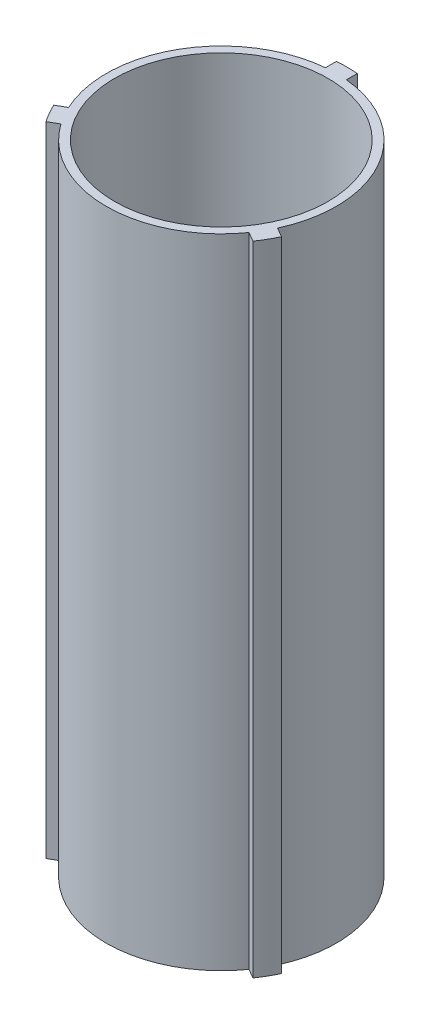
ISO-10303-21;
HEADER;
FILE_DESCRIPTION(('STEP AP214'),'2;1');
FILE_NAME('part.step','',(''),(''),'','','');
FILE_SCHEMA(('AUTOMOTIVE_DESIGN { 1 0 10303 214 1 1 1 1 }'));
ENDSEC;
DATA;
#1=APPLICATION_CONTEXT('core data for automotive mechanical design processes');
#2=APPLICATION_PROTOCOL_DEFINITION('international standard','automotive_design',2000,#1);
#3=PRODUCT_CONTEXT('',#1,'mechanical');
#4=PRODUCT('Part','Part','',(#3));
#5=PRODUCT_RELATED_PRODUCT_CATEGORY('part','',(#4));
#6=PRODUCT_DEFINITION_FORMATION('','',#4);
#7=PRODUCT_DEFINITION_CONTEXT('part definition',#1,'design');
#8=PRODUCT_DEFINITION('design','',#6,#7);
#9=PRODUCT_DEFINITION_SHAPE('','',#8);
#10=(LENGTH_UNIT() NAMED_UNIT(*) SI_UNIT(.MILLI.,.METRE.));
#11=(NAMED_UNIT(*) PLANE_ANGLE_UNIT() SI_UNIT($,.RADIAN.));
#12=(NAMED_UNIT(*) SI_UNIT($,.STERADIAN.) SOLID_ANGLE_UNIT());
#13=UNCERTAINTY_MEASURE_WITH_UNIT(LENGTH_MEASURE(1.E-05),#10,'distance_accuracy_value','');
#14=(GEOMETRIC_REPRESENTATION_CONTEXT(3) GLOBAL_UNCERTAINTY_ASSIGNED_CONTEXT((#13)) GLOBAL_UNIT_ASSIGNED_CONTEXT((#10,
#11,#12)) REPRESENTATION_CONTEXT('',''));
#15=CARTESIAN_POINT('',(0.,0.,0.));
#16=DIRECTION('',(0.,0.,1.));
#17=DIRECTION('',(1.,0.,0.));
#18=AXIS2_PLACEMENT_3D('',#15,#16,#17);
#19=CARTESIAN_POINT('',(0.,193.675,0.));
#20=DIRECTION('',(0.,1.,0.));
#21=DIRECTION('',(0.,0.,1.));
#22=AXIS2_PLACEMENT_3D('',#19,#20,#21);
#23=PLANE('',#22);
#24=CARTESIAN_POINT('',(0.,193.675,0.));
#25=DIRECTION('',(0.,1.,0.));
#26=DIRECTION('',(0.,0.,1.));
#27=AXIS2_PLACEMENT_3D('',#24,#25,#26);
#28=CIRCLE('',#27,38.227);
#29=CARTESIAN_POINT('',(3.175,193.675,-38.0949196612882));
#30=VERTEX_POINT('',#29);
#31=CARTESIAN_POINT('',(-3.175,193.675,-38.0949196612882));
#32=VERTEX_POINT('',#31);
#33=EDGE_CURVE('E176',#30,#32,#28,.T.);
#34=ORIENTED_EDGE('',*,*,#33,.T.);
#35=DIRECTION('',(0.,0.,1.));
#36=VECTOR('',#35,1.);
#37=CARTESIAN_POINT('',(-3.175,193.675,-34.780382401578));
#38=LINE('',#37,#36);
#39=CARTESIAN_POINT('',(-3.17499999999999,193.675,-34.780382401578));
#40=VERTEX_POINT('',#39);
#41=EDGE_CURVE('E104',#32,#40,#38,.T.);
#42=ORIENTED_EDGE('',*,*,#41,.T.);
#43=CARTESIAN_POINT('',(0.,193.675,0.));
#44=DIRECTION('',(0.,1.,0.));
#45=DIRECTION('',(0.,0.,1.));
#46=AXIS2_PLACEMENT_3D('',#43,#44,#45);
#47=CIRCLE('',#46,34.925);
#48=CARTESIAN_POINT('',(-31.7081947131034,193.675,14.6405605437742));
#49=VERTEX_POINT('',#48);
#50=EDGE_CURVE('E203',#40,#49,#47,.T.);
#51=ORIENTED_EDGE('',*,*,#50,.T.);
#52=DIRECTION('',(-0.866025403784438,0.,0.500000000000001));
#53=VECTOR('',#52,1.);
#54=CARTESIAN_POINT('',(-34.5786681818024,193.675,16.2978291736293));
#55=LINE('',#54,#53);
#56=CARTESIAN_POINT('',(-34.5786681818025,193.675,16.2978291736293));
#57=VERTEX_POINT('',#56);
#58=EDGE_CURVE('E222',#49,#57,#55,.T.);
#59=ORIENTED_EDGE('',*,*,#58,.T.);
#60=CARTESIAN_POINT('',(0.,193.675,0.));
#61=DIRECTION('',(0.,1.,0.));
#62=DIRECTION('',(0.,0.,1.));
#63=AXIS2_PLACEMENT_3D('',#60,#61,#62);
#64=CIRCLE('',#63,38.227);
#65=CARTESIAN_POINT('',(-31.4036681818023,193.675,21.7970904876604));
#66=VERTEX_POINT('',#65);
#67=EDGE_CURVE('E219',#57,#66,#64,.T.);
#68=ORIENTED_EDGE('',*,*,#67,.T.);
#69=DIRECTION('',(0.866025403784439,0.,-0.5));
#70=VECTOR('',#69,1.);
#71=CARTESIAN_POINT('',(-28.5331947131033,193.675,20.1398218578053));
#72=LINE('',#71,#70);
#73=CARTESIAN_POINT('',(-28.5331947131033,193.675,20.1398218578053));
#74=VERTEX_POINT('',#73);
#75=EDGE_CURVE('E221',#66,#74,#72,.T.);
#76=ORIENTED_EDGE('',*,*,#75,.T.);
#77=CARTESIAN_POINT('',(0.,193.675,0.));
#78=DIRECTION('',(0.,1.,0.));
#79=DIRECTION('',(0.,0.,1.));
#80=AXIS2_PLACEMENT_3D('',#77,#78,#79);
#81=CIRCLE('',#80,34.925);
#82=CARTESIAN_POINT('',(28.5331947131048,193.675,20.1398218578032));
#83=VERTEX_POINT('',#82);
#84=EDGE_CURVE('E224',#74,#83,#81,.T.);
#85=ORIENTED_EDGE('',*,*,#84,.T.);
#86=DIRECTION('',(0.866025403784439,0.,0.499999999999998));
#87=VECTOR('',#86,1.);
#88=CARTESIAN_POINT('',(31.4036681818038,193.675,21.7970904876583));
#89=LINE('',#88,#87);
#90=CARTESIAN_POINT('',(31.4036681818038,193.675,21.7970904876583));
#91=VERTEX_POINT('',#90);
#92=EDGE_CURVE('E230',#83,#91,#89,.T.);
#93=ORIENTED_EDGE('',*,*,#92,.T.);
#94=CARTESIAN_POINT('',(0.,193.675,0.));
#95=DIRECTION('',(0.,1.,0.));
#96=DIRECTION('',(0.,0.,1.));
#97=AXIS2_PLACEMENT_3D('',#94,#95,#96);
#98=CIRCLE('',#97,38.227);
#99=CARTESIAN_POINT('',(34.5786681818036,193.675,16.2978291736269));
#100=VERTEX_POINT('',#99);
#101=EDGE_CURVE('E135',#91,#100,#98,.T.);
#102=ORIENTED_EDGE('',*,*,#101,.T.);
#103=DIRECTION('',(-0.866025403784438,0.,-0.500000000000001));
#104=VECTOR('',#103,1.);
#105=CARTESIAN_POINT('',(31.7081947131045,193.675,14.6405605437719));
#106=LINE('',#105,#104);
#107=CARTESIAN_POINT('',(31.7081947131045,193.675,14.6405605437719));
#108=VERTEX_POINT('',#107);
#109=EDGE_CURVE('E129',#100,#108,#106,.T.);
#110=ORIENTED_EDGE('',*,*,#109,.T.);
#111=CARTESIAN_POINT('',(0.,193.675,0.));
#112=DIRECTION('',(0.,1.,0.));
#113=DIRECTION('',(0.,0.,1.));
#114=AXIS2_PLACEMENT_3D('',#111,#112,#113);
#115=CIRCLE('',#114,34.925);
#116=CARTESIAN_POINT('',(3.175,193.675,-34.780382401578));
#117=VERTEX_POINT('',#116);
#118=EDGE_CURVE('E133',#108,#117,#115,.T.);
#119=ORIENTED_EDGE('',*,*,#118,.T.);
#120=DIRECTION('',(0.,0.,-1.));
#121=VECTOR('',#120,1.);
#122=CARTESIAN_POINT('',(3.175,193.675,-38.0949196612882));
#123=LINE('',#122,#121);
#124=EDGE_CURVE('E49',#117,#30,#123,.T.);
#125=ORIENTED_EDGE('',*,*,#124,.T.);
#126=EDGE_LOOP('',(#34,#42,#51,#59,#68,#76,#85,#93,#102,#110,#119,#125));
#127=FACE_BOUND('',#126,.T.);
#128=CARTESIAN_POINT('',(0.,193.675,0.));
#129=DIRECTION('',(0.,1.,0.));
#130=DIRECTION('',(0.,0.,1.));
#131=AXIS2_PLACEMENT_3D('',#128,#129,#130);
#132=CIRCLE('',#131,32.385);
#133=CARTESIAN_POINT('',(0.,193.675,32.385));
#134=VERTEX_POINT('',#133);
#135=EDGE_CURVE('E157',#134,#134,#132,.T.);
#136=ORIENTED_EDGE('',*,*,#135,.F.);
#137=EDGE_LOOP('',(#136));
#138=FACE_BOUND('',#137,.T.);
#139=ADVANCED_FACE('F32',(#127,#138),#23,.T.);
#140=CARTESIAN_POINT('',(0.,0.,0.));
#141=DIRECTION('',(0.,1.,0.));
#142=DIRECTION('',(0.,0.,1.));
#143=AXIS2_PLACEMENT_3D('',#140,#141,#142);
#144=PLANE('',#143);
#145=CARTESIAN_POINT('',(0.,0.,0.));
#146=DIRECTION('',(0.,1.,0.));
#147=DIRECTION('',(0.,0.,1.));
#148=AXIS2_PLACEMENT_3D('',#145,#146,#147);
#149=CIRCLE('',#148,38.227);
#150=CARTESIAN_POINT('',(3.175,0.,-38.0949196612882));
#151=VERTEX_POINT('',#150);
#152=CARTESIAN_POINT('',(-3.175,0.,-38.0949196612882));
#153=VERTEX_POINT('',#152);
#154=EDGE_CURVE('E153',#151,#153,#149,.T.);
#155=ORIENTED_EDGE('',*,*,#154,.F.);
#156=DIRECTION('',(0.,0.,-1.));
#157=VECTOR('',#156,1.);
#158=CARTESIAN_POINT('',(3.175,0.,-38.0949196612882));
#159=LINE('',#158,#157);
#160=CARTESIAN_POINT('',(3.175,0.,-34.780382401578));
#161=VERTEX_POINT('',#160);
#162=EDGE_CURVE('E96',#161,#151,#159,.T.);
#163=ORIENTED_EDGE('',*,*,#162,.F.);
#164=CARTESIAN_POINT('',(0.,0.,0.));
#165=DIRECTION('',(0.,1.,0.));
#166=DIRECTION('',(0.,0.,1.));
#167=AXIS2_PLACEMENT_3D('',#164,#165,#166);
#168=CIRCLE('',#167,34.925);
#169=CARTESIAN_POINT('',(31.7081947131045,0.,14.6405605437719));
#170=VERTEX_POINT('',#169);
#171=EDGE_CURVE('E90',#170,#161,#168,.T.);
#172=ORIENTED_EDGE('',*,*,#171,.F.);
#173=DIRECTION('',(-0.866025403784438,0.,-0.500000000000001));
#174=VECTOR('',#173,1.);
#175=CARTESIAN_POINT('',(31.7081947131045,0.,14.6405605437719));
#176=LINE('',#175,#174);
#177=CARTESIAN_POINT('',(34.5786681818036,0.,16.2978291736269));
#178=VERTEX_POINT('',#177);
#179=EDGE_CURVE('E143',#178,#170,#176,.T.);
#180=ORIENTED_EDGE('',*,*,#179,.F.);
#181=CARTESIAN_POINT('',(0.,0.,0.));
#182=DIRECTION('',(0.,1.,0.));
#183=DIRECTION('',(0.,0.,1.));
#184=AXIS2_PLACEMENT_3D('',#181,#182,#183);
#185=CIRCLE('',#184,38.227);
#186=CARTESIAN_POINT('',(31.4036681818038,0.,21.7970904876583));
#187=VERTEX_POINT('',#186);
#188=EDGE_CURVE('E171',#187,#178,#185,.T.);
#189=ORIENTED_EDGE('',*,*,#188,.F.);
#190=DIRECTION('',(0.866025403784439,0.,0.499999999999998));
#191=VECTOR('',#190,1.);
#192=CARTESIAN_POINT('',(31.4036681818038,0.,21.7970904876583));
#193=LINE('',#192,#191);
#194=CARTESIAN_POINT('',(28.5331947131048,0.,20.1398218578032));
#195=VERTEX_POINT('',#194);
#196=EDGE_CURVE('E169',#195,#187,#193,.T.);
#197=ORIENTED_EDGE('',*,*,#196,.F.);
#198=CARTESIAN_POINT('',(0.,0.,0.));
#199=DIRECTION('',(0.,1.,0.));
#200=DIRECTION('',(0.,0.,1.));
#201=AXIS2_PLACEMENT_3D('',#198,#199,#200);
#202=CIRCLE('',#201,34.925);
#203=CARTESIAN_POINT('',(-28.5331947131033,0.,20.1398218578053));
#204=VERTEX_POINT('',#203);
#205=EDGE_CURVE('E167',#204,#195,#202,.T.);
#206=ORIENTED_EDGE('',*,*,#205,.F.);
#207=DIRECTION('',(0.866025403784439,0.,-0.5));
#208=VECTOR('',#207,1.);
#209=CARTESIAN_POINT('',(-28.5331947131033,0.,20.1398218578053));
#210=LINE('',#209,#208);
#211=CARTESIAN_POINT('',(-31.4036681818023,0.,21.7970904876604));
#212=VERTEX_POINT('',#211);
#213=EDGE_CURVE('E165',#212,#204,#210,.T.);
#214=ORIENTED_EDGE('',*,*,#213,.F.);
#215=CARTESIAN_POINT('',(0.,0.,0.));
#216=DIRECTION('',(0.,1.,0.));
#217=DIRECTION('',(0.,0.,1.));
#218=AXIS2_PLACEMENT_3D('',#215,#216,#217);
#219=CIRCLE('',#218,38.227);
#220=CARTESIAN_POINT('',(-34.5786681818025,0.,16.2978291736293));
#221=VERTEX_POINT('',#220);
#222=EDGE_CURVE('E163',#221,#212,#219,.T.);
#223=ORIENTED_EDGE('',*,*,#222,.F.);
#224=DIRECTION('',(-0.866025403784438,0.,0.500000000000001));
#225=VECTOR('',#224,1.);
#226=CARTESIAN_POINT('',(-34.5786681818024,0.,16.2978291736293));
#227=LINE('',#226,#225);
#228=CARTESIAN_POINT('',(-31.7081947131034,0.,14.6405605437742));
#229=VERTEX_POINT('',#228);
#230=EDGE_CURVE('E161',#229,#221,#227,.T.);
#231=ORIENTED_EDGE('',*,*,#230,.F.);
#232=CARTESIAN_POINT('',(0.,0.,0.));
#233=DIRECTION('',(0.,1.,0.));
#234=DIRECTION('',(0.,0.,1.));
#235=AXIS2_PLACEMENT_3D('',#232,#233,#234);
#236=CIRCLE('',#235,34.925);
#237=CARTESIAN_POINT('',(-3.17499999999999,0.,-34.780382401578));
#238=VERTEX_POINT('',#237);
#239=EDGE_CURVE('E159',#238,#229,#236,.T.);
#240=ORIENTED_EDGE('',*,*,#239,.F.);
#241=DIRECTION('',(0.,0.,1.));
#242=VECTOR('',#241,1.);
#243=CARTESIAN_POINT('',(-3.175,0.,-34.780382401578));
#244=LINE('',#243,#242);
#245=EDGE_CURVE('E156',#153,#238,#244,.T.);
#246=ORIENTED_EDGE('',*,*,#245,.F.);
#247=EDGE_LOOP('',(#155,#163,#172,#180,#189,#197,#206,#214,#223,#231,#240,#246));
#248=FACE_BOUND('',#247,.T.);
#249=CARTESIAN_POINT('',(0.,0.,0.));
#250=DIRECTION('',(0.,1.,0.));
#251=DIRECTION('',(0.,0.,1.));
#252=AXIS2_PLACEMENT_3D('',#249,#250,#251);
#253=CIRCLE('',#252,32.385);
#254=CARTESIAN_POINT('',(0.,0.,32.385));
#255=VERTEX_POINT('',#254);
#256=EDGE_CURVE('E377',#255,#255,#253,.T.);
#257=ORIENTED_EDGE('',*,*,#256,.T.);
#258=EDGE_LOOP('',(#257));
#259=FACE_BOUND('',#258,.T.);
#260=ADVANCED_FACE('F207',(#248,#259),#144,.F.);
#261=CARTESIAN_POINT('',(0.,193.675,0.));
#262=DIRECTION('',(0.,-1.,0.));
#263=DIRECTION('',(0.,0.,-1.));
#264=AXIS2_PLACEMENT_3D('',#261,#262,#263);
#265=CYLINDRICAL_SURFACE('',#264,38.227);
#266=ORIENTED_EDGE('',*,*,#154,.T.);
#267=DIRECTION('',(0.,-1.,0.));
#268=VECTOR('',#267,1.);
#269=CARTESIAN_POINT('',(-3.175,193.675,-38.0949196612882));
#270=LINE('',#269,#268);
#271=EDGE_CURVE('E11',#32,#153,#270,.T.);
#272=ORIENTED_EDGE('',*,*,#271,.F.);
#273=ORIENTED_EDGE('',*,*,#33,.F.);
#274=DIRECTION('',(0.,-1.,0.));
#275=VECTOR('',#274,1.);
#276=CARTESIAN_POINT('',(3.175,193.675,-38.0949196612882));
#277=LINE('',#276,#275);
#278=EDGE_CURVE('E149',#30,#151,#277,.T.);
#279=ORIENTED_EDGE('',*,*,#278,.T.);
#280=EDGE_LOOP('',(#266,#272,#273,#279));
#281=FACE_BOUND('',#280,.T.);
#282=ADVANCED_FACE('F34',(#281),#265,.T.);
#283=CARTESIAN_POINT('',(-3.175,193.675,-34.780382401578));
#284=DIRECTION('',(1.,0.,0.));
#285=DIRECTION('',(0.,0.,-1.));
#286=AXIS2_PLACEMENT_3D('',#283,#284,#285);
#287=PLANE('',#286);
#288=ORIENTED_EDGE('',*,*,#245,.T.);
#289=DIRECTION('',(0.,-1.,0.));
#290=VECTOR('',#289,1.);
#291=CARTESIAN_POINT('',(-3.17499999999999,193.675,-34.780382401578));
#292=LINE('',#291,#290);
#293=EDGE_CURVE('E41',#40,#238,#292,.T.);
#294=ORIENTED_EDGE('',*,*,#293,.F.);
#295=ORIENTED_EDGE('',*,*,#41,.F.);
#296=ORIENTED_EDGE('',*,*,#271,.T.);
#297=EDGE_LOOP('',(#288,#294,#295,#296));
#298=FACE_BOUND('',#297,.T.);
#299=ADVANCED_FACE('F264',(#298),#287,.F.);
#300=CARTESIAN_POINT('',(0.,193.675,0.));
#301=DIRECTION('',(0.,-1.,0.));
#302=DIRECTION('',(0.,0.,-1.));
#303=AXIS2_PLACEMENT_3D('',#300,#301,#302);
#304=CYLINDRICAL_SURFACE('',#303,34.925);
#305=ORIENTED_EDGE('',*,*,#239,.T.);
#306=DIRECTION('',(0.,-1.,0.));
#307=VECTOR('',#306,1.);
#308=CARTESIAN_POINT('',(-31.7081947131034,193.675,14.6405605437742));
#309=LINE('',#308,#307);
#310=EDGE_CURVE('E195',#49,#229,#309,.T.);
#311=ORIENTED_EDGE('',*,*,#310,.F.);
#312=ORIENTED_EDGE('',*,*,#50,.F.);
#313=ORIENTED_EDGE('',*,*,#293,.T.);
#314=EDGE_LOOP('',(#305,#311,#312,#313));
#315=FACE_BOUND('',#314,.T.);
#316=ADVANCED_FACE('F201',(#315),#304,.T.);
#317=CARTESIAN_POINT('',(-34.5786681818024,193.675,16.2978291736293));
#318=DIRECTION('',(0.500000000000001,0.,0.866025403784438));
#319=DIRECTION('',(0.866025403784438,0.,-0.500000000000001));
#320=AXIS2_PLACEMENT_3D('',#317,#318,#319);
#321=PLANE('',#320);
#322=ORIENTED_EDGE('',*,*,#230,.T.);
#323=DIRECTION('',(0.,-1.,0.));
#324=VECTOR('',#323,1.);
#325=CARTESIAN_POINT('',(-34.5786681818025,193.675,16.2978291736293));
#326=LINE('',#325,#324);
#327=EDGE_CURVE('E192',#57,#221,#326,.T.);
#328=ORIENTED_EDGE('',*,*,#327,.F.);
#329=ORIENTED_EDGE('',*,*,#58,.F.);
#330=ORIENTED_EDGE('',*,*,#310,.T.);
#331=EDGE_LOOP('',(#322,#328,#329,#330));
#332=FACE_BOUND('',#331,.T.);
#333=ADVANCED_FACE('F213',(#332),#321,.F.);
#334=CARTESIAN_POINT('',(0.,193.675,0.));
#335=DIRECTION('',(0.,-1.,0.));
#336=DIRECTION('',(0.,0.,-1.));
#337=AXIS2_PLACEMENT_3D('',#334,#335,#336);
#338=CYLINDRICAL_SURFACE('',#337,38.227);
#339=ORIENTED_EDGE('',*,*,#222,.T.);
#340=DIRECTION('',(0.,-1.,0.));
#341=VECTOR('',#340,1.);
#342=CARTESIAN_POINT('',(-31.4036681818023,193.675,21.7970904876604));
#343=LINE('',#342,#341);
#344=EDGE_CURVE('E189',#66,#212,#343,.T.);
#345=ORIENTED_EDGE('',*,*,#344,.F.);
#346=ORIENTED_EDGE('',*,*,#67,.F.);
#347=ORIENTED_EDGE('',*,*,#327,.T.);
#348=EDGE_LOOP('',(#339,#345,#346,#347));
#349=FACE_BOUND('',#348,.T.);
#350=ADVANCED_FACE('F217',(#349),#338,.T.);
#351=CARTESIAN_POINT('',(-28.5331947131033,193.675,20.1398218578053));
#352=DIRECTION('',(-0.5,0.,-0.866025403784439));
#353=DIRECTION('',(-0.866025403784439,0.,0.5));
#354=AXIS2_PLACEMENT_3D('',#351,#352,#353);
#355=PLANE('',#354);
#356=ORIENTED_EDGE('',*,*,#213,.T.);
#357=DIRECTION('',(0.,-1.,0.));
#358=VECTOR('',#357,1.);
#359=CARTESIAN_POINT('',(-28.5331947131033,193.675,20.1398218578053));
#360=LINE('',#359,#358);
#361=EDGE_CURVE('E186',#74,#204,#360,.T.);
#362=ORIENTED_EDGE('',*,*,#361,.F.);
#363=ORIENTED_EDGE('',*,*,#75,.F.);
#364=ORIENTED_EDGE('',*,*,#344,.T.);
#365=EDGE_LOOP('',(#356,#362,#363,#364));
#366=FACE_BOUND('',#365,.T.);
#367=ADVANCED_FACE('F277',(#366),#355,.F.);
#368=CARTESIAN_POINT('',(0.,193.675,0.));
#369=DIRECTION('',(0.,-1.,0.));
#370=DIRECTION('',(0.,0.,-1.));
#371=AXIS2_PLACEMENT_3D('',#368,#369,#370);
#372=CYLINDRICAL_SURFACE('',#371,34.925);
#373=ORIENTED_EDGE('',*,*,#205,.T.);
#374=DIRECTION('',(0.,-1.,0.));
#375=VECTOR('',#374,1.);
#376=CARTESIAN_POINT('',(28.5331947131048,193.675,20.1398218578032));
#377=LINE('',#376,#375);
#378=EDGE_CURVE('E183',#83,#195,#377,.T.);
#379=ORIENTED_EDGE('',*,*,#378,.F.);
#380=ORIENTED_EDGE('',*,*,#84,.F.);
#381=ORIENTED_EDGE('',*,*,#361,.T.);
#382=EDGE_LOOP('',(#373,#379,#380,#381));
#383=FACE_BOUND('',#382,.T.);
#384=ADVANCED_FACE('F280',(#383),#372,.T.);
#385=CARTESIAN_POINT('',(31.4036681818038,193.675,21.7970904876583));
#386=DIRECTION('',(0.499999999999998,0.,-0.866025403784439));
#387=DIRECTION('',(-0.86602540378444,0.,-0.499999999999999));
#388=AXIS2_PLACEMENT_3D('',#385,#386,#387);
#389=PLANE('',#388);
#390=ORIENTED_EDGE('',*,*,#196,.T.);
#391=DIRECTION('',(0.,-1.,0.));
#392=VECTOR('',#391,1.);
#393=CARTESIAN_POINT('',(31.4036681818038,193.675,21.7970904876583));
#394=LINE('',#393,#392);
#395=EDGE_CURVE('E180',#91,#187,#394,.T.);
#396=ORIENTED_EDGE('',*,*,#395,.F.);
#397=ORIENTED_EDGE('',*,*,#92,.F.);
#398=ORIENTED_EDGE('',*,*,#378,.T.);
#399=EDGE_LOOP('',(#390,#396,#397,#398));
#400=FACE_BOUND('',#399,.T.);
#401=ADVANCED_FACE('F236',(#400),#389,.F.);
#402=CARTESIAN_POINT('',(0.,193.675,0.));
#403=DIRECTION('',(0.,-1.,0.));
#404=DIRECTION('',(0.,0.,-1.));
#405=AXIS2_PLACEMENT_3D('',#402,#403,#404);
#406=CYLINDRICAL_SURFACE('',#405,38.227);
#407=ORIENTED_EDGE('',*,*,#188,.T.);
#408=DIRECTION('',(0.,-1.,0.));
#409=VECTOR('',#408,1.);
#410=CARTESIAN_POINT('',(34.5786681818036,193.675,16.2978291736269));
#411=LINE('',#410,#409);
#412=EDGE_CURVE('E144',#100,#178,#411,.T.);
#413=ORIENTED_EDGE('',*,*,#412,.F.);
#414=ORIENTED_EDGE('',*,*,#101,.F.);
#415=ORIENTED_EDGE('',*,*,#395,.T.);
#416=EDGE_LOOP('',(#407,#413,#414,#415));
#417=FACE_BOUND('',#416,.T.);
#418=ADVANCED_FACE('F240',(#417),#406,.T.);
#419=CARTESIAN_POINT('',(31.7081947131045,193.675,14.6405605437719));
#420=DIRECTION('',(-0.500000000000001,0.,0.866025403784438));
#421=DIRECTION('',(0.866025403784438,0.,0.500000000000002));
#422=AXIS2_PLACEMENT_3D('',#419,#420,#421);
#423=PLANE('',#422);
#424=ORIENTED_EDGE('',*,*,#179,.T.);
#425=DIRECTION('',(0.,-1.,0.));
#426=VECTOR('',#425,1.);
#427=CARTESIAN_POINT('',(31.7081947131045,193.675,14.6405605437719));
#428=LINE('',#427,#426);
#429=EDGE_CURVE('E140',#108,#170,#428,.T.);
#430=ORIENTED_EDGE('',*,*,#429,.F.);
#431=ORIENTED_EDGE('',*,*,#109,.F.);
#432=ORIENTED_EDGE('',*,*,#412,.T.);
#433=EDGE_LOOP('',(#424,#430,#431,#432));
#434=FACE_BOUND('',#433,.T.);
#435=ADVANCED_FACE('F141',(#434),#423,.F.);
#436=CARTESIAN_POINT('',(0.,193.675,0.));
#437=DIRECTION('',(0.,-1.,0.));
#438=DIRECTION('',(0.,0.,-1.));
#439=AXIS2_PLACEMENT_3D('',#436,#437,#438);
#440=CYLINDRICAL_SURFACE('',#439,34.925);
#441=ORIENTED_EDGE('',*,*,#171,.T.);
#442=DIRECTION('',(0.,-1.,0.));
#443=VECTOR('',#442,1.);
#444=CARTESIAN_POINT('',(3.175,193.675,-34.780382401578));
#445=LINE('',#444,#443);
#446=EDGE_CURVE('E145',#117,#161,#445,.T.);
#447=ORIENTED_EDGE('',*,*,#446,.F.);
#448=ORIENTED_EDGE('',*,*,#118,.F.);
#449=ORIENTED_EDGE('',*,*,#429,.T.);
#450=EDGE_LOOP('',(#441,#447,#448,#449));
#451=FACE_BOUND('',#450,.T.);
#452=ADVANCED_FACE('F147',(#451),#440,.T.);
#453=CARTESIAN_POINT('',(3.175,193.675,-38.0949196612882));
#454=DIRECTION('',(-1.,0.,0.));
#455=DIRECTION('',(0.,0.,1.));
#456=AXIS2_PLACEMENT_3D('',#453,#454,#455);
#457=PLANE('',#456);
#458=ORIENTED_EDGE('',*,*,#162,.T.);
#459=ORIENTED_EDGE('',*,*,#278,.F.);
#460=ORIENTED_EDGE('',*,*,#124,.F.);
#461=ORIENTED_EDGE('',*,*,#446,.T.);
#462=EDGE_LOOP('',(#458,#459,#460,#461));
#463=FACE_BOUND('',#462,.T.);
#464=ADVANCED_FACE('F244',(#463),#457,.F.);
#465=CARTESIAN_POINT('',(0.,193.675,0.));
#466=DIRECTION('',(0.,-1.,0.));
#467=DIRECTION('',(0.,0.,-1.));
#468=AXIS2_PLACEMENT_3D('',#465,#466,#467);
#469=CYLINDRICAL_SURFACE('',#468,32.385);
#470=ORIENTED_EDGE('',*,*,#135,.T.);
#471=EDGE_LOOP('',(#470));
#472=FACE_BOUND('',#471,.T.);
#473=ORIENTED_EDGE('',*,*,#256,.F.);
#474=EDGE_LOOP('',(#473));
#475=FACE_BOUND('',#474,.T.);
#476=ADVANCED_FACE('F246',(#472,#475),#469,.F.);
#477=CLOSED_SHELL('',(#139,#260,#282,#299,#316,#333,#350,#367,#384,#401,#418,#435,#452,#464,#476));
#478=MANIFOLD_SOLID_BREP('B2',#477);
#479=ADVANCED_BREP_SHAPE_REPRESENTATION('',(#18,#478),#14);
#480=SHAPE_DEFINITION_REPRESENTATION(#9,#479);
ENDSEC;
END-ISO-10303-21;
